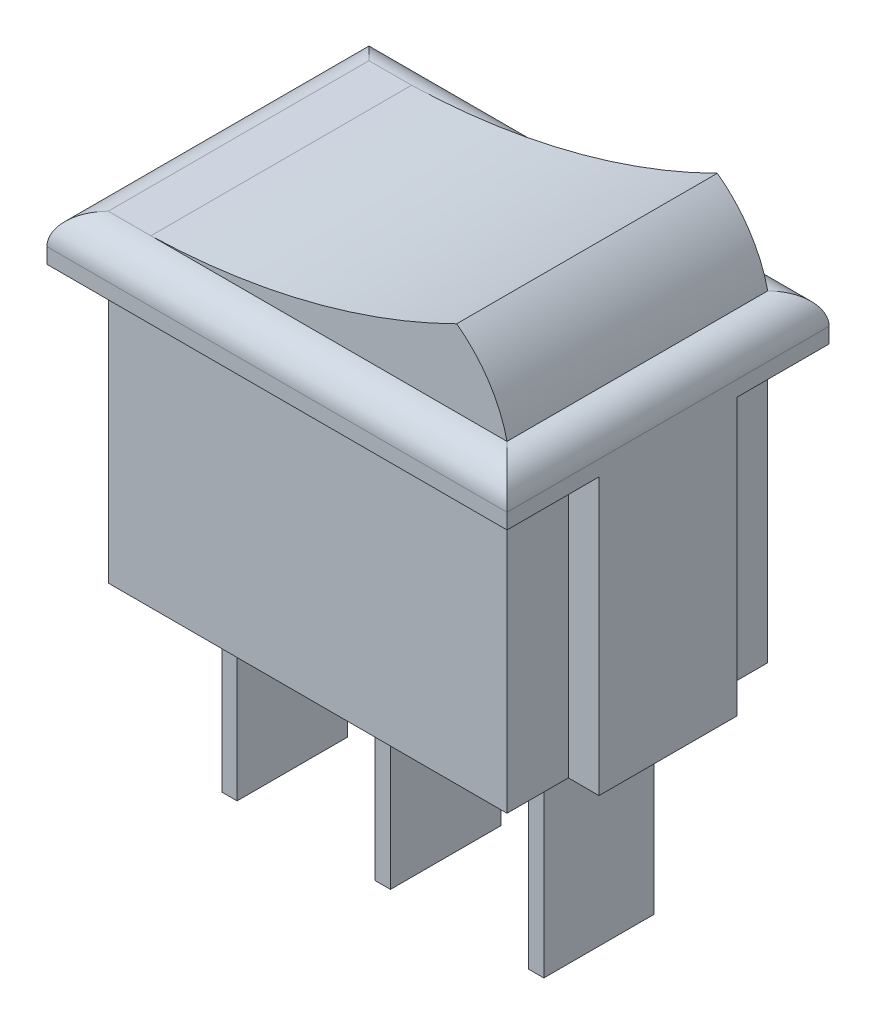
ISO-10303-21;
HEADER;
FILE_DESCRIPTION(('STEP AP214'),'2;1');
FILE_NAME('part.step','',(''),(''),'','','');
FILE_SCHEMA(('AUTOMOTIVE_DESIGN { 1 0 10303 214 1 1 1 1 }'));
ENDSEC;
DATA;
#1=APPLICATION_CONTEXT('core data for automotive mechanical design processes');
#2=APPLICATION_PROTOCOL_DEFINITION('international standard','automotive_design',2000,#1);
#3=PRODUCT_CONTEXT('',#1,'mechanical');
#4=PRODUCT('Part','Part','',(#3));
#5=PRODUCT_RELATED_PRODUCT_CATEGORY('part','',(#4));
#6=PRODUCT_DEFINITION_FORMATION('','',#4);
#7=PRODUCT_DEFINITION_CONTEXT('part definition',#1,'design');
#8=PRODUCT_DEFINITION('design','',#6,#7);
#9=PRODUCT_DEFINITION_SHAPE('','',#8);
#10=(LENGTH_UNIT() NAMED_UNIT(*) SI_UNIT(.MILLI.,.METRE.));
#11=(NAMED_UNIT(*) PLANE_ANGLE_UNIT() SI_UNIT($,.RADIAN.));
#12=(NAMED_UNIT(*) SI_UNIT($,.STERADIAN.) SOLID_ANGLE_UNIT());
#13=UNCERTAINTY_MEASURE_WITH_UNIT(LENGTH_MEASURE(1.E-05),#10,'distance_accuracy_value','');
#14=(GEOMETRIC_REPRESENTATION_CONTEXT(3) GLOBAL_UNCERTAINTY_ASSIGNED_CONTEXT((#13)) GLOBAL_UNIT_ASSIGNED_CONTEXT((#10,
#11,#12)) REPRESENTATION_CONTEXT('',''));
#15=CARTESIAN_POINT('',(0.,0.,0.));
#16=DIRECTION('',(0.,0.,1.));
#17=DIRECTION('',(1.,0.,0.));
#18=AXIS2_PLACEMENT_3D('',#15,#16,#17);
#19=CARTESIAN_POINT('',(0.,10.5,0.));
#20=DIRECTION('',(0.,1.,0.));
#21=DIRECTION('',(0.,0.,1.));
#22=AXIS2_PLACEMENT_3D('',#19,#20,#21);
#23=PLANE('',#22);
#24=DIRECTION('',(1.,0.,0.));
#25=VECTOR('',#24,1.);
#26=CARTESIAN_POINT('',(14.,10.5,0.));
#27=LINE('',#26,#25);
#28=CARTESIAN_POINT('',(0.,10.5,0.));
#29=VERTEX_POINT('',#28);
#30=CARTESIAN_POINT('',(1.38825927083258,10.5,0.));
#31=VERTEX_POINT('',#30);
#32=EDGE_CURVE('E529',#29,#31,#27,.T.);
#33=ORIENTED_EDGE('',*,*,#32,.T.);
#34=DIRECTION('',(0.,0.,-1.));
#35=VECTOR('',#34,1.);
#36=CARTESIAN_POINT('',(1.38825927083258,10.5,11.8778164138618));
#37=LINE('',#36,#35);
#38=CARTESIAN_POINT('',(1.38825927083258,10.5,-8.5));
#39=VERTEX_POINT('',#38);
#40=EDGE_CURVE('E306',#31,#39,#37,.T.);
#41=ORIENTED_EDGE('',*,*,#40,.T.);
#42=DIRECTION('',(-1.,0.,0.));
#43=VECTOR('',#42,1.);
#44=CARTESIAN_POINT('',(-1.,10.5,-8.5));
#45=LINE('',#44,#43);
#46=CARTESIAN_POINT('',(0.,10.5,-8.5));
#47=VERTEX_POINT('',#46);
#48=EDGE_CURVE('E531',#39,#47,#45,.T.);
#49=ORIENTED_EDGE('',*,*,#48,.T.);
#50=DIRECTION('',(0.,0.,1.));
#51=VECTOR('',#50,1.);
#52=CARTESIAN_POINT('',(0.,10.5,1.));
#53=LINE('',#52,#51);
#54=EDGE_CURVE('E526',#47,#29,#53,.T.);
#55=ORIENTED_EDGE('',*,*,#54,.T.);
#56=EDGE_LOOP('',(#33,#41,#49,#55));
#57=FACE_BOUND('',#56,.T.);
#58=ADVANCED_FACE('F83',(#57),#23,.T.);
#59=CARTESIAN_POINT('',(0.,0.,0.));
#60=DIRECTION('',(0.,1.,0.));
#61=DIRECTION('',(0.,0.,1.));
#62=AXIS2_PLACEMENT_3D('',#59,#60,#61);
#63=PLANE('',#62);
#64=DIRECTION('',(0.,0.,-1.));
#65=VECTOR('',#64,1.);
#66=CARTESIAN_POINT('',(6.25,0.,-2.45));
#67=LINE('',#66,#65);
#68=CARTESIAN_POINT('',(6.25,0.,-2.45));
#69=VERTEX_POINT('',#68);
#70=CARTESIAN_POINT('',(6.25,0.,-6.05));
#71=VERTEX_POINT('',#70);
#72=EDGE_CURVE('E356',#69,#71,#67,.T.);
#73=ORIENTED_EDGE('',*,*,#72,.F.);
#74=DIRECTION('',(-1.,0.,0.));
#75=VECTOR('',#74,1.);
#76=CARTESIAN_POINT('',(6.25,0.,-2.45));
#77=LINE('',#76,#75);
#78=CARTESIAN_POINT('',(6.75,0.,-2.45));
#79=VERTEX_POINT('',#78);
#80=EDGE_CURVE('E361',#79,#69,#77,.T.);
#81=ORIENTED_EDGE('',*,*,#80,.F.);
#82=DIRECTION('',(0.,0.,1.));
#83=VECTOR('',#82,1.);
#84=CARTESIAN_POINT('',(6.75,0.,-2.45));
#85=LINE('',#84,#83);
#86=CARTESIAN_POINT('',(6.75,0.,-6.05));
#87=VERTEX_POINT('',#86);
#88=EDGE_CURVE('E373',#87,#79,#85,.T.);
#89=ORIENTED_EDGE('',*,*,#88,.F.);
#90=DIRECTION('',(1.,0.,0.));
#91=VECTOR('',#90,1.);
#92=CARTESIAN_POINT('',(6.25,0.,-6.05));
#93=LINE('',#92,#91);
#94=EDGE_CURVE('E370',#71,#87,#93,.T.);
#95=ORIENTED_EDGE('',*,*,#94,.F.);
#96=EDGE_LOOP('',(#73,#81,#89,#95));
#97=FACE_BOUND('',#96,.T.);
#98=DIRECTION('',(1.,0.,0.));
#99=VECTOR('',#98,1.);
#100=CARTESIAN_POINT('',(0.,0.,-8.5));
#101=LINE('',#100,#99);
#102=CARTESIAN_POINT('',(0.,0.,-8.5));
#103=VERTEX_POINT('',#102);
#104=CARTESIAN_POINT('',(13.,0.,-8.5));
#105=VERTEX_POINT('',#104);
#106=EDGE_CURVE('E467',#103,#105,#101,.T.);
#107=ORIENTED_EDGE('',*,*,#106,.T.);
#108=DIRECTION('',(0.,0.,-1.));
#109=VECTOR('',#108,1.);
#110=CARTESIAN_POINT('',(13.,0.,0.));
#111=LINE('',#110,#109);
#112=CARTESIAN_POINT('',(13.,0.,-6.5));
#113=VERTEX_POINT('',#112);
#114=EDGE_CURVE('E485',#113,#105,#111,.T.);
#115=ORIENTED_EDGE('',*,*,#114,.F.);
#116=DIRECTION('',(-1.,0.,0.));
#117=VECTOR('',#116,1.);
#118=CARTESIAN_POINT('',(14.,0.,-6.5));
#119=LINE('',#118,#117);
#120=CARTESIAN_POINT('',(14.,0.,-6.5));
#121=VERTEX_POINT('',#120);
#122=EDGE_CURVE('E445',#121,#113,#119,.T.);
#123=ORIENTED_EDGE('',*,*,#122,.F.);
#124=DIRECTION('',(0.,0.,1.));
#125=VECTOR('',#124,1.);
#126=CARTESIAN_POINT('',(14.,0.,-6.5));
#127=LINE('',#126,#125);
#128=CARTESIAN_POINT('',(14.,0.,-2.));
#129=VERTEX_POINT('',#128);
#130=EDGE_CURVE('E511',#121,#129,#127,.T.);
#131=ORIENTED_EDGE('',*,*,#130,.T.);
#132=DIRECTION('',(-1.,0.,0.));
#133=VECTOR('',#132,1.);
#134=CARTESIAN_POINT('',(14.,0.,-2.));
#135=LINE('',#134,#133);
#136=CARTESIAN_POINT('',(13.,0.,-2.));
#137=VERTEX_POINT('',#136);
#138=EDGE_CURVE('E517',#129,#137,#135,.T.);
#139=ORIENTED_EDGE('',*,*,#138,.T.);
#140=CARTESIAN_POINT('',(13.,0.,0.));
#141=VERTEX_POINT('',#140);
#142=EDGE_CURVE('E449',#141,#137,#111,.T.);
#143=ORIENTED_EDGE('',*,*,#142,.F.);
#144=DIRECTION('',(1.,0.,0.));
#145=VECTOR('',#144,1.);
#146=CARTESIAN_POINT('',(0.,0.,0.));
#147=LINE('',#146,#145);
#148=CARTESIAN_POINT('',(0.,0.,0.));
#149=VERTEX_POINT('',#148);
#150=EDGE_CURVE('E483',#149,#141,#147,.T.);
#151=ORIENTED_EDGE('',*,*,#150,.F.);
#152=DIRECTION('',(0.,0.,-1.));
#153=VECTOR('',#152,1.);
#154=CARTESIAN_POINT('',(0.,0.,0.));
#155=LINE('',#154,#153);
#156=CARTESIAN_POINT('',(0.,0.,-2.));
#157=VERTEX_POINT('',#156);
#158=EDGE_CURVE('E475',#149,#157,#155,.T.);
#159=ORIENTED_EDGE('',*,*,#158,.T.);
#160=DIRECTION('',(1.,0.,0.));
#161=VECTOR('',#160,1.);
#162=CARTESIAN_POINT('',(0.,0.,-2.));
#163=LINE('',#162,#161);
#164=CARTESIAN_POINT('',(-0.999999999999998,0.,-2.));
#165=VERTEX_POINT('',#164);
#166=EDGE_CURVE('E480',#165,#157,#163,.T.);
#167=ORIENTED_EDGE('',*,*,#166,.F.);
#168=DIRECTION('',(0.,0.,1.));
#169=VECTOR('',#168,1.);
#170=CARTESIAN_POINT('',(-0.999999999999996,0.,0.));
#171=LINE('',#170,#169);
#172=CARTESIAN_POINT('',(-1.,0.,-6.5));
#173=VERTEX_POINT('',#172);
#174=EDGE_CURVE('E478',#173,#165,#171,.T.);
#175=ORIENTED_EDGE('',*,*,#174,.F.);
#176=DIRECTION('',(1.,0.,0.));
#177=VECTOR('',#176,1.);
#178=CARTESIAN_POINT('',(0.,0.,-6.5));
#179=LINE('',#178,#177);
#180=CARTESIAN_POINT('',(0.,0.,-6.5));
#181=VERTEX_POINT('',#180);
#182=EDGE_CURVE('E474',#173,#181,#179,.T.);
#183=ORIENTED_EDGE('',*,*,#182,.T.);
#184=EDGE_CURVE('E470',#181,#103,#155,.T.);
#185=ORIENTED_EDGE('',*,*,#184,.T.);
#186=EDGE_LOOP('',(#107,#115,#123,#131,#139,#143,#151,#159,#167,#175,#183,#185));
#187=FACE_BOUND('',#186,.T.);
#188=DIRECTION('',(0.,0.,-1.));
#189=VECTOR('',#188,1.);
#190=CARTESIAN_POINT('',(1.25,0.,-2.45));
#191=LINE('',#190,#189);
#192=CARTESIAN_POINT('',(1.25,0.,-2.45));
#193=VERTEX_POINT('',#192);
#194=CARTESIAN_POINT('',(1.25,0.,-6.05));
#195=VERTEX_POINT('',#194);
#196=EDGE_CURVE('E389',#193,#195,#191,.T.);
#197=ORIENTED_EDGE('',*,*,#196,.F.);
#198=DIRECTION('',(-1.,0.,0.));
#199=VECTOR('',#198,1.);
#200=CARTESIAN_POINT('',(1.25,0.,-2.45));
#201=LINE('',#200,#199);
#202=CARTESIAN_POINT('',(1.75,0.,-2.45));
#203=VERTEX_POINT('',#202);
#204=EDGE_CURVE('E394',#203,#193,#201,.T.);
#205=ORIENTED_EDGE('',*,*,#204,.F.);
#206=DIRECTION('',(0.,0.,1.));
#207=VECTOR('',#206,1.);
#208=CARTESIAN_POINT('',(1.75,0.,-2.45));
#209=LINE('',#208,#207);
#210=CARTESIAN_POINT('',(1.75,0.,-6.05));
#211=VERTEX_POINT('',#210);
#212=EDGE_CURVE('E406',#211,#203,#209,.T.);
#213=ORIENTED_EDGE('',*,*,#212,.F.);
#214=DIRECTION('',(1.,0.,0.));
#215=VECTOR('',#214,1.);
#216=CARTESIAN_POINT('',(1.25,0.,-6.05));
#217=LINE('',#216,#215);
#218=EDGE_CURVE('E403',#195,#211,#217,.T.);
#219=ORIENTED_EDGE('',*,*,#218,.F.);
#220=EDGE_LOOP('',(#197,#205,#213,#219));
#221=FACE_BOUND('',#220,.T.);
#222=DIRECTION('',(0.,0.,-1.));
#223=VECTOR('',#222,1.);
#224=CARTESIAN_POINT('',(11.25,0.,-2.45));
#225=LINE('',#224,#223);
#226=CARTESIAN_POINT('',(11.25,0.,-2.45));
#227=VERTEX_POINT('',#226);
#228=CARTESIAN_POINT('',(11.25,0.,-6.05));
#229=VERTEX_POINT('',#228);
#230=EDGE_CURVE('E326',#227,#229,#225,.T.);
#231=ORIENTED_EDGE('',*,*,#230,.F.);
#232=DIRECTION('',(-1.,0.,0.));
#233=VECTOR('',#232,1.);
#234=CARTESIAN_POINT('',(11.25,0.,-2.45));
#235=LINE('',#234,#233);
#236=CARTESIAN_POINT('',(11.75,0.,-2.45));
#237=VERTEX_POINT('',#236);
#238=EDGE_CURVE('E331',#237,#227,#235,.T.);
#239=ORIENTED_EDGE('',*,*,#238,.F.);
#240=DIRECTION('',(0.,0.,1.));
#241=VECTOR('',#240,1.);
#242=CARTESIAN_POINT('',(11.75,0.,-2.45));
#243=LINE('',#242,#241);
#244=CARTESIAN_POINT('',(11.75,0.,-6.05));
#245=VERTEX_POINT('',#244);
#246=EDGE_CURVE('E341',#245,#237,#243,.T.);
#247=ORIENTED_EDGE('',*,*,#246,.F.);
#248=DIRECTION('',(1.,0.,0.));
#249=VECTOR('',#248,1.);
#250=CARTESIAN_POINT('',(11.25,0.,-6.05));
#251=LINE('',#250,#249);
#252=EDGE_CURVE('E108',#229,#245,#251,.T.);
#253=ORIENTED_EDGE('',*,*,#252,.F.);
#254=EDGE_LOOP('',(#231,#239,#247,#253));
#255=FACE_BOUND('',#254,.T.);
#256=ADVANCED_FACE('F594',(#97,#187,#221,#255),#63,.F.);
#257=CARTESIAN_POINT('',(0.,9.,0.));
#258=DIRECTION('',(-1.,0.,0.));
#259=DIRECTION('',(0.,0.,1.));
#260=AXIS2_PLACEMENT_3D('',#257,#258,#259);
#261=PLANE('',#260);
#262=ORIENTED_EDGE('',*,*,#158,.F.);
#263=DIRECTION('',(0.,-1.,0.));
#264=VECTOR('',#263,1.);
#265=CARTESIAN_POINT('',(0.,9.,0.));
#266=LINE('',#265,#264);
#267=CARTESIAN_POINT('',(0.,9.,0.));
#268=VERTEX_POINT('',#267);
#269=EDGE_CURVE('E493',#268,#149,#266,.T.);
#270=ORIENTED_EDGE('',*,*,#269,.F.);
#271=DIRECTION('',(0.,0.,-1.));
#272=VECTOR('',#271,1.);
#273=CARTESIAN_POINT('',(0.,9.,0.));
#274=LINE('',#273,#272);
#275=CARTESIAN_POINT('',(0.,9.,-2.));
#276=VERTEX_POINT('',#275);
#277=EDGE_CURVE('E453',#268,#276,#274,.T.);
#278=ORIENTED_EDGE('',*,*,#277,.T.);
#279=DIRECTION('',(0.,-1.,0.));
#280=VECTOR('',#279,1.);
#281=CARTESIAN_POINT('',(0.,9.,-2.));
#282=LINE('',#281,#280);
#283=EDGE_CURVE('E495',#276,#157,#282,.T.);
#284=ORIENTED_EDGE('',*,*,#283,.T.);
#285=EDGE_LOOP('',(#262,#270,#278,#284));
#286=FACE_BOUND('',#285,.T.);
#287=ADVANCED_FACE('F628',(#286),#261,.T.);
#288=CARTESIAN_POINT('',(0.,9.,-2.));
#289=DIRECTION('',(0.,0.,-1.));
#290=DIRECTION('',(-1.,0.,0.));
#291=AXIS2_PLACEMENT_3D('',#288,#289,#290);
#292=PLANE('',#291);
#293=ORIENTED_EDGE('',*,*,#166,.T.);
#294=ORIENTED_EDGE('',*,*,#283,.F.);
#295=DIRECTION('',(1.,0.,0.));
#296=VECTOR('',#295,1.);
#297=CARTESIAN_POINT('',(0.,9.,-2.));
#298=LINE('',#297,#296);
#299=CARTESIAN_POINT('',(-0.999999999999998,9.,-2.));
#300=VERTEX_POINT('',#299);
#301=EDGE_CURVE('E456',#300,#276,#298,.T.);
#302=ORIENTED_EDGE('',*,*,#301,.F.);
#303=DIRECTION('',(0.,-1.,0.));
#304=VECTOR('',#303,1.);
#305=CARTESIAN_POINT('',(-0.999999999999998,9.,-2.));
#306=LINE('',#305,#304);
#307=EDGE_CURVE('E497',#300,#165,#306,.T.);
#308=ORIENTED_EDGE('',*,*,#307,.T.);
#309=EDGE_LOOP('',(#293,#294,#302,#308));
#310=FACE_BOUND('',#309,.T.);
#311=ADVANCED_FACE('F631',(#310),#292,.F.);
#312=CARTESIAN_POINT('',(-0.999999999999996,9.,0.));
#313=DIRECTION('',(1.,0.,0.));
#314=DIRECTION('',(0.,0.,-1.));
#315=AXIS2_PLACEMENT_3D('',#312,#313,#314);
#316=PLANE('',#315);
#317=DIRECTION('',(0.,-1.,0.));
#318=VECTOR('',#317,1.);
#319=CARTESIAN_POINT('',(-0.999999999999999,10.5,1.));
#320=LINE('',#319,#318);
#321=CARTESIAN_POINT('',(-0.999999999999999,9.5,1.));
#322=VERTEX_POINT('',#321);
#323=CARTESIAN_POINT('',(-0.999999999999999,9.,1.));
#324=VERTEX_POINT('',#323);
#325=EDGE_CURVE('E443',#322,#324,#320,.T.);
#326=ORIENTED_EDGE('',*,*,#325,.F.);
#327=DIRECTION('',(0.,0.,1.));
#328=VECTOR('',#327,1.);
#329=CARTESIAN_POINT('',(-1.,9.5,-9.5));
#330=LINE('',#329,#328);
#331=CARTESIAN_POINT('',(-1.,9.5,-9.5));
#332=VERTEX_POINT('',#331);
#333=EDGE_CURVE('E12',#322,#332,#330,.F.);
#334=ORIENTED_EDGE('',*,*,#333,.T.);
#335=DIRECTION('',(0.,-1.,0.));
#336=VECTOR('',#335,1.);
#337=CARTESIAN_POINT('',(-1.,10.5,-9.5));
#338=LINE('',#337,#336);
#339=CARTESIAN_POINT('',(-1.,9.,-9.5));
#340=VERTEX_POINT('',#339);
#341=EDGE_CURVE('E437',#332,#340,#338,.T.);
#342=ORIENTED_EDGE('',*,*,#341,.T.);
#343=DIRECTION('',(0.,0.,1.));
#344=VECTOR('',#343,1.);
#345=CARTESIAN_POINT('',(-1.,9.,-9.5));
#346=LINE('',#345,#344);
#347=CARTESIAN_POINT('',(-1.,9.,-6.5));
#348=VERTEX_POINT('',#347);
#349=EDGE_CURVE('E423',#340,#348,#346,.T.);
#350=ORIENTED_EDGE('',*,*,#349,.T.);
#351=DIRECTION('',(0.,-1.,0.));
#352=VECTOR('',#351,1.);
#353=CARTESIAN_POINT('',(-1.,9.,-6.5));
#354=LINE('',#353,#352);
#355=EDGE_CURVE('E500',#348,#173,#354,.T.);
#356=ORIENTED_EDGE('',*,*,#355,.T.);
#357=ORIENTED_EDGE('',*,*,#174,.T.);
#358=ORIENTED_EDGE('',*,*,#307,.F.);
#359=EDGE_CURVE('E427',#300,#324,#346,.T.);
#360=ORIENTED_EDGE('',*,*,#359,.T.);
#361=EDGE_LOOP('',(#326,#334,#342,#350,#356,#357,#358,#360));
#362=FACE_BOUND('',#361,.T.);
#363=ADVANCED_FACE('F557',(#362),#316,.F.);
#364=CARTESIAN_POINT('',(0.,9.,-6.5));
#365=DIRECTION('',(0.,0.,-1.));
#366=DIRECTION('',(-1.,0.,0.));
#367=AXIS2_PLACEMENT_3D('',#364,#365,#366);
#368=PLANE('',#367);
#369=ORIENTED_EDGE('',*,*,#182,.F.);
#370=ORIENTED_EDGE('',*,*,#355,.F.);
#371=DIRECTION('',(1.,0.,0.));
#372=VECTOR('',#371,1.);
#373=CARTESIAN_POINT('',(0.,9.,-6.5));
#374=LINE('',#373,#372);
#375=CARTESIAN_POINT('',(0.,9.,-6.5));
#376=VERTEX_POINT('',#375);
#377=EDGE_CURVE('E452',#348,#376,#374,.T.);
#378=ORIENTED_EDGE('',*,*,#377,.T.);
#379=DIRECTION('',(0.,-1.,0.));
#380=VECTOR('',#379,1.);
#381=CARTESIAN_POINT('',(0.,9.,-6.5));
#382=LINE('',#381,#380);
#383=EDGE_CURVE('E502',#376,#181,#382,.T.);
#384=ORIENTED_EDGE('',*,*,#383,.T.);
#385=EDGE_LOOP('',(#369,#370,#378,#384));
#386=FACE_BOUND('',#385,.T.);
#387=ADVANCED_FACE('F597',(#386),#368,.T.);
#388=ORIENTED_EDGE('',*,*,#184,.F.);
#389=ORIENTED_EDGE('',*,*,#383,.F.);
#390=CARTESIAN_POINT('',(0.,9.,-8.5));
#391=VERTEX_POINT('',#390);
#392=EDGE_CURVE('E448',#376,#391,#274,.T.);
#393=ORIENTED_EDGE('',*,*,#392,.T.);
#394=DIRECTION('',(0.,-1.,0.));
#395=VECTOR('',#394,1.);
#396=CARTESIAN_POINT('',(0.,9.,-8.5));
#397=LINE('',#396,#395);
#398=EDGE_CURVE('E504',#391,#103,#397,.T.);
#399=ORIENTED_EDGE('',*,*,#398,.T.);
#400=EDGE_LOOP('',(#388,#389,#393,#399));
#401=FACE_BOUND('',#400,.T.);
#402=ADVANCED_FACE('F600',(#401),#261,.T.);
#403=CARTESIAN_POINT('',(0.,9.,0.));
#404=DIRECTION('',(0.,0.,-1.));
#405=DIRECTION('',(-1.,0.,0.));
#406=AXIS2_PLACEMENT_3D('',#403,#404,#405);
#407=PLANE('',#406);
#408=ORIENTED_EDGE('',*,*,#150,.T.);
#409=DIRECTION('',(0.,-1.,0.));
#410=VECTOR('',#409,1.);
#411=CARTESIAN_POINT('',(13.,9.,0.));
#412=LINE('',#411,#410);
#413=CARTESIAN_POINT('',(13.,9.,0.));
#414=VERTEX_POINT('',#413);
#415=EDGE_CURVE('E490',#414,#141,#412,.T.);
#416=ORIENTED_EDGE('',*,*,#415,.F.);
#417=DIRECTION('',(1.,0.,0.));
#418=VECTOR('',#417,1.);
#419=CARTESIAN_POINT('',(0.,9.,0.));
#420=LINE('',#419,#418);
#421=EDGE_CURVE('E459',#268,#414,#420,.T.);
#422=ORIENTED_EDGE('',*,*,#421,.F.);
#423=ORIENTED_EDGE('',*,*,#269,.T.);
#424=EDGE_LOOP('',(#408,#416,#422,#423));
#425=FACE_BOUND('',#424,.T.);
#426=ADVANCED_FACE('F624',(#425),#407,.F.);
#427=CARTESIAN_POINT('',(0.,9.,-8.5));
#428=DIRECTION('',(0.,0.,-1.));
#429=DIRECTION('',(-1.,0.,0.));
#430=AXIS2_PLACEMENT_3D('',#427,#428,#429);
#431=PLANE('',#430);
#432=ORIENTED_EDGE('',*,*,#106,.F.);
#433=ORIENTED_EDGE('',*,*,#398,.F.);
#434=DIRECTION('',(1.,0.,0.));
#435=VECTOR('',#434,1.);
#436=CARTESIAN_POINT('',(0.,9.,-8.5));
#437=LINE('',#436,#435);
#438=CARTESIAN_POINT('',(13.,9.,-8.5));
#439=VERTEX_POINT('',#438);
#440=EDGE_CURVE('E446',#391,#439,#437,.T.);
#441=ORIENTED_EDGE('',*,*,#440,.T.);
#442=DIRECTION('',(0.,-1.,0.));
#443=VECTOR('',#442,1.);
#444=CARTESIAN_POINT('',(13.,9.,-8.5));
#445=LINE('',#444,#443);
#446=EDGE_CURVE('E466',#439,#105,#445,.T.);
#447=ORIENTED_EDGE('',*,*,#446,.T.);
#448=EDGE_LOOP('',(#432,#433,#441,#447));
#449=FACE_BOUND('',#448,.T.);
#450=ADVANCED_FACE('F605',(#449),#431,.T.);
#451=CARTESIAN_POINT('',(13.,9.,0.));
#452=DIRECTION('',(-1.,0.,0.));
#453=DIRECTION('',(0.,0.,1.));
#454=AXIS2_PLACEMENT_3D('',#451,#452,#453);
#455=PLANE('',#454);
#456=DIRECTION('',(0.,0.,-1.));
#457=VECTOR('',#456,1.);
#458=CARTESIAN_POINT('',(13.,9.,0.));
#459=LINE('',#458,#457);
#460=CARTESIAN_POINT('',(13.,9.,-6.5));
#461=VERTEX_POINT('',#460);
#462=EDGE_CURVE('E462',#461,#439,#459,.T.);
#463=ORIENTED_EDGE('',*,*,#462,.F.);
#464=DIRECTION('',(0.,-1.,0.));
#465=VECTOR('',#464,1.);
#466=CARTESIAN_POINT('',(13.,9.,-6.5));
#467=LINE('',#466,#465);
#468=EDGE_CURVE('E506',#461,#113,#467,.T.);
#469=ORIENTED_EDGE('',*,*,#468,.T.);
#470=ORIENTED_EDGE('',*,*,#114,.T.);
#471=ORIENTED_EDGE('',*,*,#446,.F.);
#472=EDGE_LOOP('',(#463,#469,#470,#471));
#473=FACE_BOUND('',#472,.T.);
#474=ADVANCED_FACE('F611',(#473),#455,.F.);
#475=DIRECTION('',(0.,-1.,0.));
#476=VECTOR('',#475,1.);
#477=CARTESIAN_POINT('',(13.,9.,-2.));
#478=LINE('',#477,#476);
#479=CARTESIAN_POINT('',(13.,9.,-2.));
#480=VERTEX_POINT('',#479);
#481=EDGE_CURVE('E524',#480,#137,#478,.T.);
#482=ORIENTED_EDGE('',*,*,#481,.F.);
#483=EDGE_CURVE('E463',#414,#480,#459,.T.);
#484=ORIENTED_EDGE('',*,*,#483,.F.);
#485=ORIENTED_EDGE('',*,*,#415,.T.);
#486=ORIENTED_EDGE('',*,*,#142,.T.);
#487=EDGE_LOOP('',(#482,#484,#485,#486));
#488=FACE_BOUND('',#487,.T.);
#489=ADVANCED_FACE('F620',(#488),#455,.F.);
#490=CARTESIAN_POINT('',(14.,9.,-6.5));
#491=DIRECTION('',(1.,0.,0.));
#492=DIRECTION('',(0.,0.,-1.));
#493=AXIS2_PLACEMENT_3D('',#490,#491,#492);
#494=PLANE('',#493);
#495=DIRECTION('',(0.,-1.,0.));
#496=VECTOR('',#495,1.);
#497=CARTESIAN_POINT('',(14.,10.5,-9.5));
#498=LINE('',#497,#496);
#499=CARTESIAN_POINT('',(14.,9.5,-9.5));
#500=VERTEX_POINT('',#499);
#501=CARTESIAN_POINT('',(14.,9.,-9.5));
#502=VERTEX_POINT('',#501);
#503=EDGE_CURVE('E439',#500,#502,#498,.T.);
#504=ORIENTED_EDGE('',*,*,#503,.F.);
#505=DIRECTION('',(0.,0.,-1.));
#506=VECTOR('',#505,1.);
#507=CARTESIAN_POINT('',(14.,9.5,-6.5));
#508=LINE('',#507,#506);
#509=CARTESIAN_POINT('',(14.,9.5,1.));
#510=VERTEX_POINT('',#509);
#511=EDGE_CURVE('E92',#500,#510,#508,.F.);
#512=ORIENTED_EDGE('',*,*,#511,.T.);
#513=DIRECTION('',(0.,-1.,0.));
#514=VECTOR('',#513,1.);
#515=CARTESIAN_POINT('',(14.,10.5,1.));
#516=LINE('',#515,#514);
#517=CARTESIAN_POINT('',(14.,9.,1.));
#518=VERTEX_POINT('',#517);
#519=EDGE_CURVE('E441',#510,#518,#516,.T.);
#520=ORIENTED_EDGE('',*,*,#519,.T.);
#521=DIRECTION('',(0.,0.,-1.));
#522=VECTOR('',#521,1.);
#523=CARTESIAN_POINT('',(14.,9.,-9.5));
#524=LINE('',#523,#522);
#525=CARTESIAN_POINT('',(14.,9.,-2.));
#526=VERTEX_POINT('',#525);
#527=EDGE_CURVE('E431',#518,#526,#524,.T.);
#528=ORIENTED_EDGE('',*,*,#527,.T.);
#529=DIRECTION('',(0.,-1.,0.));
#530=VECTOR('',#529,1.);
#531=CARTESIAN_POINT('',(14.,9.,-2.));
#532=LINE('',#531,#530);
#533=EDGE_CURVE('E471',#526,#129,#532,.T.);
#534=ORIENTED_EDGE('',*,*,#533,.T.);
#535=ORIENTED_EDGE('',*,*,#130,.F.);
#536=DIRECTION('',(0.,-1.,0.));
#537=VECTOR('',#536,1.);
#538=CARTESIAN_POINT('',(14.,9.,-6.5));
#539=LINE('',#538,#537);
#540=CARTESIAN_POINT('',(14.,9.,-6.5));
#541=VERTEX_POINT('',#540);
#542=EDGE_CURVE('E514',#541,#121,#539,.T.);
#543=ORIENTED_EDGE('',*,*,#542,.F.);
#544=EDGE_CURVE('E430',#541,#502,#524,.T.);
#545=ORIENTED_EDGE('',*,*,#544,.T.);
#546=EDGE_LOOP('',(#504,#512,#520,#528,#534,#535,#543,#545));
#547=FACE_BOUND('',#546,.T.);
#548=ADVANCED_FACE('F580',(#547),#494,.T.);
#549=CARTESIAN_POINT('',(14.,9.,-6.5));
#550=DIRECTION('',(0.,0.,1.));
#551=DIRECTION('',(1.,0.,0.));
#552=AXIS2_PLACEMENT_3D('',#549,#550,#551);
#553=PLANE('',#552);
#554=ORIENTED_EDGE('',*,*,#122,.T.);
#555=ORIENTED_EDGE('',*,*,#468,.F.);
#556=DIRECTION('',(-1.,0.,0.));
#557=VECTOR('',#556,1.);
#558=CARTESIAN_POINT('',(14.,9.,-6.5));
#559=LINE('',#558,#557);
#560=EDGE_CURVE('E507',#541,#461,#559,.T.);
#561=ORIENTED_EDGE('',*,*,#560,.F.);
#562=ORIENTED_EDGE('',*,*,#542,.T.);
#563=EDGE_LOOP('',(#554,#555,#561,#562));
#564=FACE_BOUND('',#563,.T.);
#565=ADVANCED_FACE('F613',(#564),#553,.F.);
#566=CARTESIAN_POINT('',(14.,9.,-2.));
#567=DIRECTION('',(0.,0.,1.));
#568=DIRECTION('',(1.,0.,0.));
#569=AXIS2_PLACEMENT_3D('',#566,#567,#568);
#570=PLANE('',#569);
#571=ORIENTED_EDGE('',*,*,#138,.F.);
#572=ORIENTED_EDGE('',*,*,#533,.F.);
#573=DIRECTION('',(-1.,0.,0.));
#574=VECTOR('',#573,1.);
#575=CARTESIAN_POINT('',(14.,9.,-2.));
#576=LINE('',#575,#574);
#577=EDGE_CURVE('E510',#526,#480,#576,.T.);
#578=ORIENTED_EDGE('',*,*,#577,.T.);
#579=ORIENTED_EDGE('',*,*,#481,.T.);
#580=EDGE_LOOP('',(#571,#572,#578,#579));
#581=FACE_BOUND('',#580,.T.);
#582=ADVANCED_FACE('F616',(#581),#570,.T.);
#583=CARTESIAN_POINT('',(0.,9.,0.));
#584=DIRECTION('',(0.,1.,0.));
#585=DIRECTION('',(0.,0.,1.));
#586=AXIS2_PLACEMENT_3D('',#583,#584,#585);
#587=PLANE('',#586);
#588=ORIENTED_EDGE('',*,*,#359,.F.);
#589=ORIENTED_EDGE('',*,*,#301,.T.);
#590=ORIENTED_EDGE('',*,*,#277,.F.);
#591=ORIENTED_EDGE('',*,*,#421,.T.);
#592=ORIENTED_EDGE('',*,*,#483,.T.);
#593=ORIENTED_EDGE('',*,*,#577,.F.);
#594=ORIENTED_EDGE('',*,*,#527,.F.);
#595=DIRECTION('',(1.,0.,0.));
#596=VECTOR('',#595,1.);
#597=CARTESIAN_POINT('',(-0.999999999999999,9.,1.));
#598=LINE('',#597,#596);
#599=EDGE_CURVE('E426',#324,#518,#598,.T.);
#600=ORIENTED_EDGE('',*,*,#599,.F.);
#601=EDGE_LOOP('',(#588,#589,#590,#591,#592,#593,#594,#600));
#602=FACE_BOUND('',#601,.T.);
#603=ADVANCED_FACE('F561',(#602),#587,.F.);
#604=CARTESIAN_POINT('',(-0.999999999999999,10.5,1.));
#605=DIRECTION('',(0.,0.,-1.));
#606=DIRECTION('',(-1.,0.,0.));
#607=AXIS2_PLACEMENT_3D('',#604,#605,#606);
#608=PLANE('',#607);
#609=ORIENTED_EDGE('',*,*,#519,.F.);
#610=DIRECTION('',(1.,0.,0.));
#611=VECTOR('',#610,1.);
#612=CARTESIAN_POINT('',(-0.999999999999999,9.5,1.));
#613=LINE('',#612,#611);
#614=EDGE_CURVE('E537',#510,#322,#613,.F.);
#615=ORIENTED_EDGE('',*,*,#614,.T.);
#616=ORIENTED_EDGE('',*,*,#325,.T.);
#617=ORIENTED_EDGE('',*,*,#599,.T.);
#618=EDGE_LOOP('',(#609,#615,#616,#617));
#619=FACE_BOUND('',#618,.T.);
#620=ADVANCED_FACE('F565',(#619),#608,.F.);
#621=CARTESIAN_POINT('',(-1.,10.5,-9.5));
#622=DIRECTION('',(0.,0.,1.));
#623=DIRECTION('',(1.,0.,0.));
#624=AXIS2_PLACEMENT_3D('',#621,#622,#623);
#625=PLANE('',#624);
#626=ORIENTED_EDGE('',*,*,#341,.F.);
#627=DIRECTION('',(-1.,0.,0.));
#628=VECTOR('',#627,1.);
#629=CARTESIAN_POINT('',(14.,9.5,-9.5));
#630=LINE('',#629,#628);
#631=EDGE_CURVE('E534',#332,#500,#630,.F.);
#632=ORIENTED_EDGE('',*,*,#631,.T.);
#633=ORIENTED_EDGE('',*,*,#503,.T.);
#634=DIRECTION('',(-1.,0.,0.));
#635=VECTOR('',#634,1.);
#636=CARTESIAN_POINT('',(-1.,9.,-9.5));
#637=LINE('',#636,#635);
#638=EDGE_CURVE('E434',#502,#340,#637,.T.);
#639=ORIENTED_EDGE('',*,*,#638,.T.);
#640=EDGE_LOOP('',(#626,#632,#633,#639));
#641=FACE_BOUND('',#640,.T.);
#642=ADVANCED_FACE('F572',(#641),#625,.F.);
#643=ORIENTED_EDGE('',*,*,#377,.F.);
#644=ORIENTED_EDGE('',*,*,#349,.F.);
#645=ORIENTED_EDGE('',*,*,#638,.F.);
#646=ORIENTED_EDGE('',*,*,#544,.F.);
#647=ORIENTED_EDGE('',*,*,#560,.T.);
#648=ORIENTED_EDGE('',*,*,#462,.T.);
#649=ORIENTED_EDGE('',*,*,#440,.F.);
#650=ORIENTED_EDGE('',*,*,#392,.F.);
#651=EDGE_LOOP('',(#643,#644,#645,#646,#647,#648,#649,#650));
#652=FACE_BOUND('',#651,.T.);
#653=ADVANCED_FACE('F587',(#652),#587,.F.);
#654=CARTESIAN_POINT('',(0.,9.5,0.));
#655=DIRECTION('',(-1.,0.,0.));
#656=DIRECTION('',(0.,0.,1.));
#657=AXIS2_PLACEMENT_3D('',#654,#655,#656);
#658=CYLINDRICAL_SURFACE('',#657,1.);
#659=CARTESIAN_POINT('',(0.,9.5,0.));
#660=DIRECTION('',(-0.707106781186548,0.,-0.707106781186547));
#661=DIRECTION('',(0.707106781186547,0.,-0.707106781186548));
#662=AXIS2_PLACEMENT_3D('',#659,#660,#661);
#663=ELLIPSE('',#662,1.41421356237309,1.);
#664=EDGE_CURVE('E543',#322,#29,#663,.T.);
#665=ORIENTED_EDGE('',*,*,#664,.F.);
#666=ORIENTED_EDGE('',*,*,#614,.F.);
#667=CARTESIAN_POINT('',(13.,9.5,0.));
#668=DIRECTION('',(0.707106781186548,0.,-0.707106781186547));
#669=DIRECTION('',(-0.707106781186547,0.,-0.707106781186548));
#670=AXIS2_PLACEMENT_3D('',#667,#668,#669);
#671=ELLIPSE('',#670,1.41421356237309,1.);
#672=CARTESIAN_POINT('',(13.,10.5,0.));
#673=VERTEX_POINT('',#672);
#674=EDGE_CURVE('E87',#673,#510,#671,.T.);
#675=ORIENTED_EDGE('',*,*,#674,.F.);
#676=DIRECTION('',(1.,0.,0.));
#677=VECTOR('',#676,1.);
#678=CARTESIAN_POINT('',(0.,10.5,0.));
#679=LINE('',#678,#677);
#680=EDGE_CURVE('E100',#31,#673,#679,.T.);
#681=ORIENTED_EDGE('',*,*,#680,.F.);
#682=ORIENTED_EDGE('',*,*,#32,.F.);
#683=EDGE_LOOP('',(#665,#666,#675,#681,#682));
#684=FACE_BOUND('',#683,.T.);
#685=ADVANCED_FACE('F85',(#684),#658,.T.);
#686=CARTESIAN_POINT('',(13.,9.5,0.));
#687=DIRECTION('',(0.,0.,-1.));
#688=DIRECTION('',(-1.,0.,0.));
#689=AXIS2_PLACEMENT_3D('',#686,#687,#688);
#690=CYLINDRICAL_SURFACE('',#689,1.);
#691=ORIENTED_EDGE('',*,*,#674,.T.);
#692=ORIENTED_EDGE('',*,*,#511,.F.);
#693=CARTESIAN_POINT('',(13.,9.5,-8.5));
#694=DIRECTION('',(-0.707106781186547,0.,-0.707106781186548));
#695=DIRECTION('',(0.707106781186548,0.,-0.707106781186547));
#696=AXIS2_PLACEMENT_3D('',#693,#694,#695);
#697=ELLIPSE('',#696,1.4142135623731,1.);
#698=CARTESIAN_POINT('',(13.,10.5,-8.5));
#699=VERTEX_POINT('',#698);
#700=EDGE_CURVE('E542',#699,#500,#697,.T.);
#701=ORIENTED_EDGE('',*,*,#700,.F.);
#702=DIRECTION('',(0.,0.,-1.));
#703=VECTOR('',#702,1.);
#704=CARTESIAN_POINT('',(13.,10.5,0.));
#705=LINE('',#704,#703);
#706=EDGE_CURVE('E318',#673,#699,#705,.T.);
#707=ORIENTED_EDGE('',*,*,#706,.F.);
#708=EDGE_LOOP('',(#691,#692,#701,#707));
#709=FACE_BOUND('',#708,.T.);
#710=ADVANCED_FACE('F578',(#709),#690,.T.);
#711=CARTESIAN_POINT('',(0.,9.5,0.));
#712=DIRECTION('',(0.,0.,-1.));
#713=DIRECTION('',(-1.,0.,0.));
#714=AXIS2_PLACEMENT_3D('',#711,#712,#713);
#715=CYLINDRICAL_SURFACE('',#714,1.);
#716=ORIENTED_EDGE('',*,*,#664,.T.);
#717=ORIENTED_EDGE('',*,*,#54,.F.);
#718=CARTESIAN_POINT('',(0.,9.5,-8.5));
#719=DIRECTION('',(0.707106781186547,0.,-0.707106781186548));
#720=DIRECTION('',(-0.707106781186548,0.,-0.707106781186547));
#721=AXIS2_PLACEMENT_3D('',#718,#719,#720);
#722=ELLIPSE('',#721,1.4142135623731,1.);
#723=EDGE_CURVE('E422',#332,#47,#722,.T.);
#724=ORIENTED_EDGE('',*,*,#723,.F.);
#725=ORIENTED_EDGE('',*,*,#333,.F.);
#726=EDGE_LOOP('',(#716,#717,#724,#725));
#727=FACE_BOUND('',#726,.T.);
#728=ADVANCED_FACE('F568',(#727),#715,.T.);
#729=CARTESIAN_POINT('',(0.,9.5,-8.5));
#730=DIRECTION('',(1.,0.,0.));
#731=DIRECTION('',(0.,0.,-1.));
#732=AXIS2_PLACEMENT_3D('',#729,#730,#731);
#733=CYLINDRICAL_SURFACE('',#732,1.);
#734=ORIENTED_EDGE('',*,*,#700,.T.);
#735=ORIENTED_EDGE('',*,*,#631,.F.);
#736=ORIENTED_EDGE('',*,*,#723,.T.);
#737=ORIENTED_EDGE('',*,*,#48,.F.);
#738=EDGE_CURVE('E313',#699,#39,#45,.T.);
#739=ORIENTED_EDGE('',*,*,#738,.F.);
#740=EDGE_LOOP('',(#734,#735,#736,#737,#739));
#741=FACE_BOUND('',#740,.T.);
#742=ADVANCED_FACE('F577',(#741),#733,.T.);
#743=CARTESIAN_POINT('',(1.25,-6.5,-2.45));
#744=DIRECTION('',(1.,0.,0.));
#745=DIRECTION('',(0.,0.,-1.));
#746=AXIS2_PLACEMENT_3D('',#743,#744,#745);
#747=PLANE('',#746);
#748=ORIENTED_EDGE('',*,*,#196,.T.);
#749=DIRECTION('',(0.,1.,0.));
#750=VECTOR('',#749,1.);
#751=CARTESIAN_POINT('',(1.25,-6.5,-6.05));
#752=LINE('',#751,#750);
#753=CARTESIAN_POINT('',(1.25,-6.5,-6.05));
#754=VERTEX_POINT('',#753);
#755=EDGE_CURVE('E419',#754,#195,#752,.T.);
#756=ORIENTED_EDGE('',*,*,#755,.F.);
#757=DIRECTION('',(0.,0.,-1.));
#758=VECTOR('',#757,1.);
#759=CARTESIAN_POINT('',(1.25,-6.5,-2.45));
#760=LINE('',#759,#758);
#761=CARTESIAN_POINT('',(1.25,-6.5,-2.45));
#762=VERTEX_POINT('',#761);
#763=EDGE_CURVE('E390',#762,#754,#760,.T.);
#764=ORIENTED_EDGE('',*,*,#763,.F.);
#765=DIRECTION('',(0.,1.,0.));
#766=VECTOR('',#765,1.);
#767=CARTESIAN_POINT('',(1.25,-6.5,-2.45));
#768=LINE('',#767,#766);
#769=EDGE_CURVE('E400',#762,#193,#768,.T.);
#770=ORIENTED_EDGE('',*,*,#769,.T.);
#771=EDGE_LOOP('',(#748,#756,#764,#770));
#772=FACE_BOUND('',#771,.T.);
#773=ADVANCED_FACE('F653',(#772),#747,.F.);
#774=CARTESIAN_POINT('',(1.25,-6.5,-6.05));
#775=DIRECTION('',(0.,0.,1.));
#776=DIRECTION('',(1.,0.,0.));
#777=AXIS2_PLACEMENT_3D('',#774,#775,#776);
#778=PLANE('',#777);
#779=ORIENTED_EDGE('',*,*,#218,.T.);
#780=DIRECTION('',(0.,1.,0.));
#781=VECTOR('',#780,1.);
#782=CARTESIAN_POINT('',(1.75,-6.5,-6.05));
#783=LINE('',#782,#781);
#784=CARTESIAN_POINT('',(1.75,-6.5,-6.05));
#785=VERTEX_POINT('',#784);
#786=EDGE_CURVE('E416',#785,#211,#783,.T.);
#787=ORIENTED_EDGE('',*,*,#786,.F.);
#788=DIRECTION('',(1.,0.,0.));
#789=VECTOR('',#788,1.);
#790=CARTESIAN_POINT('',(1.25,-6.5,-6.05));
#791=LINE('',#790,#789);
#792=EDGE_CURVE('E393',#754,#785,#791,.T.);
#793=ORIENTED_EDGE('',*,*,#792,.F.);
#794=ORIENTED_EDGE('',*,*,#755,.T.);
#795=EDGE_LOOP('',(#779,#787,#793,#794));
#796=FACE_BOUND('',#795,.T.);
#797=ADVANCED_FACE('F850',(#796),#778,.F.);
#798=CARTESIAN_POINT('',(1.75,-6.5,-2.45));
#799=DIRECTION('',(-1.,0.,0.));
#800=DIRECTION('',(0.,0.,1.));
#801=AXIS2_PLACEMENT_3D('',#798,#799,#800);
#802=PLANE('',#801);
#803=ORIENTED_EDGE('',*,*,#212,.T.);
#804=DIRECTION('',(0.,1.,0.));
#805=VECTOR('',#804,1.);
#806=CARTESIAN_POINT('',(1.75,-6.5,-2.45));
#807=LINE('',#806,#805);
#808=CARTESIAN_POINT('',(1.75,-6.5,-2.45));
#809=VERTEX_POINT('',#808);
#810=EDGE_CURVE('E413',#809,#203,#807,.T.);
#811=ORIENTED_EDGE('',*,*,#810,.F.);
#812=DIRECTION('',(0.,0.,1.));
#813=VECTOR('',#812,1.);
#814=CARTESIAN_POINT('',(1.75,-6.5,-2.45));
#815=LINE('',#814,#813);
#816=EDGE_CURVE('E396',#785,#809,#815,.T.);
#817=ORIENTED_EDGE('',*,*,#816,.F.);
#818=ORIENTED_EDGE('',*,*,#786,.T.);
#819=EDGE_LOOP('',(#803,#811,#817,#818));
#820=FACE_BOUND('',#819,.T.);
#821=ADVANCED_FACE('F839',(#820),#802,.F.);
#822=CARTESIAN_POINT('',(1.25,-6.5,-2.45));
#823=DIRECTION('',(0.,0.,-1.));
#824=DIRECTION('',(-1.,0.,0.));
#825=AXIS2_PLACEMENT_3D('',#822,#823,#824);
#826=PLANE('',#825);
#827=ORIENTED_EDGE('',*,*,#204,.T.);
#828=ORIENTED_EDGE('',*,*,#769,.F.);
#829=DIRECTION('',(-1.,0.,0.));
#830=VECTOR('',#829,1.);
#831=CARTESIAN_POINT('',(1.25,-6.5,-2.45));
#832=LINE('',#831,#830);
#833=EDGE_CURVE('E398',#809,#762,#832,.T.);
#834=ORIENTED_EDGE('',*,*,#833,.F.);
#835=ORIENTED_EDGE('',*,*,#810,.T.);
#836=EDGE_LOOP('',(#827,#828,#834,#835));
#837=FACE_BOUND('',#836,.T.);
#838=ADVANCED_FACE('F828',(#837),#826,.F.);
#839=CARTESIAN_POINT('',(0.,-6.5,0.));
#840=DIRECTION('',(0.,-1.,0.));
#841=DIRECTION('',(0.,0.,-1.));
#842=AXIS2_PLACEMENT_3D('',#839,#840,#841);
#843=PLANE('',#842);
#844=ORIENTED_EDGE('',*,*,#763,.T.);
#845=ORIENTED_EDGE('',*,*,#792,.T.);
#846=ORIENTED_EDGE('',*,*,#816,.T.);
#847=ORIENTED_EDGE('',*,*,#833,.T.);
#848=EDGE_LOOP('',(#844,#845,#846,#847));
#849=FACE_BOUND('',#848,.T.);
#850=ADVANCED_FACE('F816',(#849),#843,.T.);
#851=CARTESIAN_POINT('',(6.25,-6.5,-2.45));
#852=DIRECTION('',(1.,0.,0.));
#853=DIRECTION('',(0.,0.,-1.));
#854=AXIS2_PLACEMENT_3D('',#851,#852,#853);
#855=PLANE('',#854);
#856=ORIENTED_EDGE('',*,*,#72,.T.);
#857=DIRECTION('',(0.,1.,0.));
#858=VECTOR('',#857,1.);
#859=CARTESIAN_POINT('',(6.25,-6.5,-6.05));
#860=LINE('',#859,#858);
#861=CARTESIAN_POINT('',(6.25,-6.5,-6.05));
#862=VERTEX_POINT('',#861);
#863=EDGE_CURVE('E386',#862,#71,#860,.T.);
#864=ORIENTED_EDGE('',*,*,#863,.F.);
#865=DIRECTION('',(0.,0.,-1.));
#866=VECTOR('',#865,1.);
#867=CARTESIAN_POINT('',(6.25,-6.5,-2.45));
#868=LINE('',#867,#866);
#869=CARTESIAN_POINT('',(6.25,-6.5,-2.45));
#870=VERTEX_POINT('',#869);
#871=EDGE_CURVE('E357',#870,#862,#868,.T.);
#872=ORIENTED_EDGE('',*,*,#871,.F.);
#873=DIRECTION('',(0.,1.,0.));
#874=VECTOR('',#873,1.);
#875=CARTESIAN_POINT('',(6.25,-6.5,-2.45));
#876=LINE('',#875,#874);
#877=EDGE_CURVE('E367',#870,#69,#876,.T.);
#878=ORIENTED_EDGE('',*,*,#877,.T.);
#879=EDGE_LOOP('',(#856,#864,#872,#878));
#880=FACE_BOUND('',#879,.T.);
#881=ADVANCED_FACE('F804',(#880),#855,.F.);
#882=CARTESIAN_POINT('',(6.25,-6.5,-6.05));
#883=DIRECTION('',(0.,0.,1.));
#884=DIRECTION('',(1.,0.,0.));
#885=AXIS2_PLACEMENT_3D('',#882,#883,#884);
#886=PLANE('',#885);
#887=ORIENTED_EDGE('',*,*,#94,.T.);
#888=DIRECTION('',(0.,1.,0.));
#889=VECTOR('',#888,1.);
#890=CARTESIAN_POINT('',(6.75,-6.5,-6.05));
#891=LINE('',#890,#889);
#892=CARTESIAN_POINT('',(6.75,-6.5,-6.05));
#893=VERTEX_POINT('',#892);
#894=EDGE_CURVE('E383',#893,#87,#891,.T.);
#895=ORIENTED_EDGE('',*,*,#894,.F.);
#896=DIRECTION('',(1.,0.,0.));
#897=VECTOR('',#896,1.);
#898=CARTESIAN_POINT('',(6.25,-6.5,-6.05));
#899=LINE('',#898,#897);
#900=EDGE_CURVE('E360',#862,#893,#899,.T.);
#901=ORIENTED_EDGE('',*,*,#900,.F.);
#902=ORIENTED_EDGE('',*,*,#863,.T.);
#903=EDGE_LOOP('',(#887,#895,#901,#902));
#904=FACE_BOUND('',#903,.T.);
#905=ADVANCED_FACE('F793',(#904),#886,.F.);
#906=CARTESIAN_POINT('',(6.75,-6.5,-2.45));
#907=DIRECTION('',(-1.,0.,0.));
#908=DIRECTION('',(0.,0.,1.));
#909=AXIS2_PLACEMENT_3D('',#906,#907,#908);
#910=PLANE('',#909);
#911=ORIENTED_EDGE('',*,*,#88,.T.);
#912=DIRECTION('',(0.,1.,0.));
#913=VECTOR('',#912,1.);
#914=CARTESIAN_POINT('',(6.75,-6.5,-2.45));
#915=LINE('',#914,#913);
#916=CARTESIAN_POINT('',(6.75,-6.5,-2.45));
#917=VERTEX_POINT('',#916);
#918=EDGE_CURVE('E380',#917,#79,#915,.T.);
#919=ORIENTED_EDGE('',*,*,#918,.F.);
#920=DIRECTION('',(0.,0.,1.));
#921=VECTOR('',#920,1.);
#922=CARTESIAN_POINT('',(6.75,-6.5,-2.45));
#923=LINE('',#922,#921);
#924=EDGE_CURVE('E363',#893,#917,#923,.T.);
#925=ORIENTED_EDGE('',*,*,#924,.F.);
#926=ORIENTED_EDGE('',*,*,#894,.T.);
#927=EDGE_LOOP('',(#911,#919,#925,#926));
#928=FACE_BOUND('',#927,.T.);
#929=ADVANCED_FACE('F782',(#928),#910,.F.);
#930=CARTESIAN_POINT('',(6.25,-6.5,-2.45));
#931=DIRECTION('',(0.,0.,-1.));
#932=DIRECTION('',(-1.,0.,0.));
#933=AXIS2_PLACEMENT_3D('',#930,#931,#932);
#934=PLANE('',#933);
#935=ORIENTED_EDGE('',*,*,#80,.T.);
#936=ORIENTED_EDGE('',*,*,#877,.F.);
#937=DIRECTION('',(-1.,0.,0.));
#938=VECTOR('',#937,1.);
#939=CARTESIAN_POINT('',(6.25,-6.5,-2.45));
#940=LINE('',#939,#938);
#941=EDGE_CURVE('E365',#917,#870,#940,.T.);
#942=ORIENTED_EDGE('',*,*,#941,.F.);
#943=ORIENTED_EDGE('',*,*,#918,.T.);
#944=EDGE_LOOP('',(#935,#936,#942,#943));
#945=FACE_BOUND('',#944,.T.);
#946=ADVANCED_FACE('F770',(#945),#934,.F.);
#947=CARTESIAN_POINT('',(0.,-6.5,0.));
#948=DIRECTION('',(0.,-1.,0.));
#949=DIRECTION('',(0.,0.,-1.));
#950=AXIS2_PLACEMENT_3D('',#947,#948,#949);
#951=PLANE('',#950);
#952=ORIENTED_EDGE('',*,*,#871,.T.);
#953=ORIENTED_EDGE('',*,*,#900,.T.);
#954=ORIENTED_EDGE('',*,*,#924,.T.);
#955=ORIENTED_EDGE('',*,*,#941,.T.);
#956=EDGE_LOOP('',(#952,#953,#954,#955));
#957=FACE_BOUND('',#956,.T.);
#958=ADVANCED_FACE('F757',(#957),#951,.T.);
#959=CARTESIAN_POINT('',(11.25,-6.5,-2.45));
#960=DIRECTION('',(1.,0.,0.));
#961=DIRECTION('',(0.,0.,-1.));
#962=AXIS2_PLACEMENT_3D('',#959,#960,#961);
#963=PLANE('',#962);
#964=ORIENTED_EDGE('',*,*,#230,.T.);
#965=DIRECTION('',(0.,1.,0.));
#966=VECTOR('',#965,1.);
#967=CARTESIAN_POINT('',(11.25,-6.5,-6.05));
#968=LINE('',#967,#966);
#969=CARTESIAN_POINT('',(11.25,-6.5,-6.05));
#970=VERTEX_POINT('',#969);
#971=EDGE_CURVE('E354',#970,#229,#968,.T.);
#972=ORIENTED_EDGE('',*,*,#971,.F.);
#973=DIRECTION('',(0.,0.,-1.));
#974=VECTOR('',#973,1.);
#975=CARTESIAN_POINT('',(11.25,-6.5,-2.45));
#976=LINE('',#975,#974);
#977=CARTESIAN_POINT('',(11.25,-6.5,-2.45));
#978=VERTEX_POINT('',#977);
#979=EDGE_CURVE('E327',#978,#970,#976,.T.);
#980=ORIENTED_EDGE('',*,*,#979,.F.);
#981=DIRECTION('',(0.,1.,0.));
#982=VECTOR('',#981,1.);
#983=CARTESIAN_POINT('',(11.25,-6.5,-2.45));
#984=LINE('',#983,#982);
#985=EDGE_CURVE('E337',#978,#227,#984,.T.);
#986=ORIENTED_EDGE('',*,*,#985,.T.);
#987=EDGE_LOOP('',(#964,#972,#980,#986));
#988=FACE_BOUND('',#987,.T.);
#989=ADVANCED_FACE('F744',(#988),#963,.F.);
#990=CARTESIAN_POINT('',(11.25,-6.5,-6.05));
#991=DIRECTION('',(0.,0.,1.));
#992=DIRECTION('',(1.,0.,0.));
#993=AXIS2_PLACEMENT_3D('',#990,#991,#992);
#994=PLANE('',#993);
#995=ORIENTED_EDGE('',*,*,#252,.T.);
#996=DIRECTION('',(0.,1.,0.));
#997=VECTOR('',#996,1.);
#998=CARTESIAN_POINT('',(11.75,-6.5,-6.05));
#999=LINE('',#998,#997);
#1000=CARTESIAN_POINT('',(11.75,-6.5,-6.05));
#1001=VERTEX_POINT('',#1000);
#1002=EDGE_CURVE('E351',#1001,#245,#999,.T.);
#1003=ORIENTED_EDGE('',*,*,#1002,.F.);
#1004=DIRECTION('',(1.,0.,0.));
#1005=VECTOR('',#1004,1.);
#1006=CARTESIAN_POINT('',(11.25,-6.5,-6.05));
#1007=LINE('',#1006,#1005);
#1008=EDGE_CURVE('E330',#970,#1001,#1007,.T.);
#1009=ORIENTED_EDGE('',*,*,#1008,.F.);
#1010=ORIENTED_EDGE('',*,*,#971,.T.);
#1011=EDGE_LOOP('',(#995,#1003,#1009,#1010));
#1012=FACE_BOUND('',#1011,.T.);
#1013=ADVANCED_FACE('F731',(#1012),#994,.F.);
#1014=CARTESIAN_POINT('',(11.75,-6.5,-2.45));
#1015=DIRECTION('',(-1.,0.,0.));
#1016=DIRECTION('',(0.,0.,1.));
#1017=AXIS2_PLACEMENT_3D('',#1014,#1015,#1016);
#1018=PLANE('',#1017);
#1019=ORIENTED_EDGE('',*,*,#246,.T.);
#1020=DIRECTION('',(0.,1.,0.));
#1021=VECTOR('',#1020,1.);
#1022=CARTESIAN_POINT('',(11.75,-6.5,-2.45));
#1023=LINE('',#1022,#1021);
#1024=CARTESIAN_POINT('',(11.75,-6.5,-2.45));
#1025=VERTEX_POINT('',#1024);
#1026=EDGE_CURVE('E348',#1025,#237,#1023,.T.);
#1027=ORIENTED_EDGE('',*,*,#1026,.F.);
#1028=DIRECTION('',(0.,0.,1.));
#1029=VECTOR('',#1028,1.);
#1030=CARTESIAN_POINT('',(11.75,-6.5,-2.45));
#1031=LINE('',#1030,#1029);
#1032=EDGE_CURVE('E333',#1001,#1025,#1031,.T.);
#1033=ORIENTED_EDGE('',*,*,#1032,.F.);
#1034=ORIENTED_EDGE('',*,*,#1002,.T.);
#1035=EDGE_LOOP('',(#1019,#1027,#1033,#1034));
#1036=FACE_BOUND('',#1035,.T.);
#1037=ADVANCED_FACE('F718',(#1036),#1018,.F.);
#1038=CARTESIAN_POINT('',(11.25,-6.5,-2.45));
#1039=DIRECTION('',(0.,0.,-1.));
#1040=DIRECTION('',(-1.,0.,0.));
#1041=AXIS2_PLACEMENT_3D('',#1038,#1039,#1040);
#1042=PLANE('',#1041);
#1043=ORIENTED_EDGE('',*,*,#238,.T.);
#1044=ORIENTED_EDGE('',*,*,#985,.F.);
#1045=DIRECTION('',(-1.,0.,0.));
#1046=VECTOR('',#1045,1.);
#1047=CARTESIAN_POINT('',(11.25,-6.5,-2.45));
#1048=LINE('',#1047,#1046);
#1049=EDGE_CURVE('E335',#1025,#978,#1048,.T.);
#1050=ORIENTED_EDGE('',*,*,#1049,.F.);
#1051=ORIENTED_EDGE('',*,*,#1026,.T.);
#1052=EDGE_LOOP('',(#1043,#1044,#1050,#1051));
#1053=FACE_BOUND('',#1052,.T.);
#1054=ADVANCED_FACE('F705',(#1053),#1042,.F.);
#1055=CARTESIAN_POINT('',(0.,-6.5,0.));
#1056=DIRECTION('',(0.,-1.,0.));
#1057=DIRECTION('',(0.,0.,-1.));
#1058=AXIS2_PLACEMENT_3D('',#1055,#1056,#1057);
#1059=PLANE('',#1058);
#1060=ORIENTED_EDGE('',*,*,#979,.T.);
#1061=ORIENTED_EDGE('',*,*,#1008,.T.);
#1062=ORIENTED_EDGE('',*,*,#1032,.T.);
#1063=ORIENTED_EDGE('',*,*,#1049,.T.);
#1064=EDGE_LOOP('',(#1060,#1061,#1062,#1063));
#1065=FACE_BOUND('',#1064,.T.);
#1066=ADVANCED_FACE('F700',(#1065),#1059,.T.);
#1067=CARTESIAN_POINT('',(0.694129635416484,34.3980860889334,11.8778164138618));
#1068=DIRECTION('',(0.,0.,-1.));
#1069=DIRECTION('',(-1.,0.,0.));
#1070=AXIS2_PLACEMENT_3D('',#1067,#1068,#1069);
#1071=CYLINDRICAL_SURFACE('',#1070,23.9081646025962);
#1072=ORIENTED_EDGE('',*,*,#40,.F.);
#1073=CARTESIAN_POINT('',(0.694129635416484,34.3980860889334,0.));
#1074=DIRECTION('',(0.,0.,-1.));
#1075=DIRECTION('',(-1.,0.,0.));
#1076=AXIS2_PLACEMENT_3D('',#1073,#1074,#1075);
#1077=CIRCLE('',#1076,23.9081646025962);
#1078=CARTESIAN_POINT('',(11.3581929508432,13.,0.));
#1079=VERTEX_POINT('',#1078);
#1080=EDGE_CURVE('E302',#31,#1079,#1077,.F.);
#1081=ORIENTED_EDGE('',*,*,#1080,.T.);
#1082=DIRECTION('',(0.,0.,-1.));
#1083=VECTOR('',#1082,1.);
#1084=CARTESIAN_POINT('',(11.3581929508432,13.,11.8778164138618));
#1085=LINE('',#1084,#1083);
#1086=CARTESIAN_POINT('',(11.3581929508432,13.,-8.5));
#1087=VERTEX_POINT('',#1086);
#1088=EDGE_CURVE('E295',#1079,#1087,#1085,.T.);
#1089=ORIENTED_EDGE('',*,*,#1088,.T.);
#1090=CARTESIAN_POINT('',(0.694129635416484,34.3980860889334,-8.5));
#1091=DIRECTION('',(0.,0.,-1.));
#1092=DIRECTION('',(-1.,0.,0.));
#1093=AXIS2_PLACEMENT_3D('',#1090,#1091,#1092);
#1094=CIRCLE('',#1093,23.9081646025962);
#1095=EDGE_CURVE('E299',#1087,#39,#1094,.T.);
#1096=ORIENTED_EDGE('',*,*,#1095,.T.);
#1097=EDGE_LOOP('',(#1072,#1081,#1089,#1096));
#1098=FACE_BOUND('',#1097,.T.);
#1099=ADVANCED_FACE('F298',(#1098),#1071,.F.);
#1100=CARTESIAN_POINT('',(8.82628421167248,9.54813167635095,11.8778164138618));
#1101=DIRECTION('',(0.,0.,-1.));
#1102=DIRECTION('',(-1.,0.,0.));
#1103=AXIS2_PLACEMENT_3D('',#1100,#1101,#1102);
#1104=CYLINDRICAL_SURFACE('',#1103,4.28088271122918);
#1105=CARTESIAN_POINT('',(8.82628421167248,9.54813167635095,0.));
#1106=DIRECTION('',(0.,0.,-1.));
#1107=DIRECTION('',(-1.,0.,0.));
#1108=AXIS2_PLACEMENT_3D('',#1105,#1106,#1107);
#1109=CIRCLE('',#1108,4.28088271122918);
#1110=EDGE_CURVE('E324',#673,#1079,#1109,.F.);
#1111=ORIENTED_EDGE('',*,*,#1110,.F.);
#1112=ORIENTED_EDGE('',*,*,#706,.T.);
#1113=CARTESIAN_POINT('',(8.82628421167248,9.54813167635095,-8.5));
#1114=DIRECTION('',(0.,0.,-1.));
#1115=DIRECTION('',(-1.,0.,0.));
#1116=AXIS2_PLACEMENT_3D('',#1113,#1114,#1115);
#1117=CIRCLE('',#1116,4.28088271122918);
#1118=EDGE_CURVE('E307',#1087,#699,#1117,.T.);
#1119=ORIENTED_EDGE('',*,*,#1118,.F.);
#1120=ORIENTED_EDGE('',*,*,#1088,.F.);
#1121=EDGE_LOOP('',(#1111,#1112,#1119,#1120));
#1122=FACE_BOUND('',#1121,.T.);
#1123=ADVANCED_FACE('F316',(#1122),#1104,.T.);
#1124=CARTESIAN_POINT('',(0.,0.,-8.5));
#1125=DIRECTION('',(0.,0.,-1.));
#1126=DIRECTION('',(-1.,0.,0.));
#1127=AXIS2_PLACEMENT_3D('',#1124,#1125,#1126);
#1128=PLANE('',#1127);
#1129=ORIENTED_EDGE('',*,*,#1095,.F.);
#1130=ORIENTED_EDGE('',*,*,#1118,.T.);
#1131=ORIENTED_EDGE('',*,*,#738,.T.);
#1132=EDGE_LOOP('',(#1129,#1130,#1131));
#1133=FACE_BOUND('',#1132,.T.);
#1134=ADVANCED_FACE('F311',(#1133),#1128,.T.);
#1135=CARTESIAN_POINT('',(0.,9.,0.));
#1136=DIRECTION('',(0.,0.,-1.));
#1137=DIRECTION('',(-1.,0.,0.));
#1138=AXIS2_PLACEMENT_3D('',#1135,#1136,#1137);
#1139=PLANE('',#1138);
#1140=ORIENTED_EDGE('',*,*,#680,.T.);
#1141=ORIENTED_EDGE('',*,*,#1110,.T.);
#1142=ORIENTED_EDGE('',*,*,#1080,.F.);
#1143=EDGE_LOOP('',(#1140,#1141,#1142));
#1144=FACE_BOUND('',#1143,.T.);
#1145=ADVANCED_FACE('F995',(#1144),#1139,.F.);
#1146=CLOSED_SHELL('',(#58,#256,#287,#311,#363,#387,#402,#426,#450,#474,#489,#548,#565,#582,
#603,#620,#642,#653,#685,#710,#728,#742,#773,#797,#821,#838,#850,#881,#905,#929,#946,#958,#989,
#1013,#1037,#1054,#1066,#1099,#1123,#1134,#1145));
#1147=MANIFOLD_SOLID_BREP('B2',#1146);
#1148=ADVANCED_BREP_SHAPE_REPRESENTATION('',(#18,#1147),#14);
#1149=SHAPE_DEFINITION_REPRESENTATION(#9,#1148);
ENDSEC;
END-ISO-10303-21;
